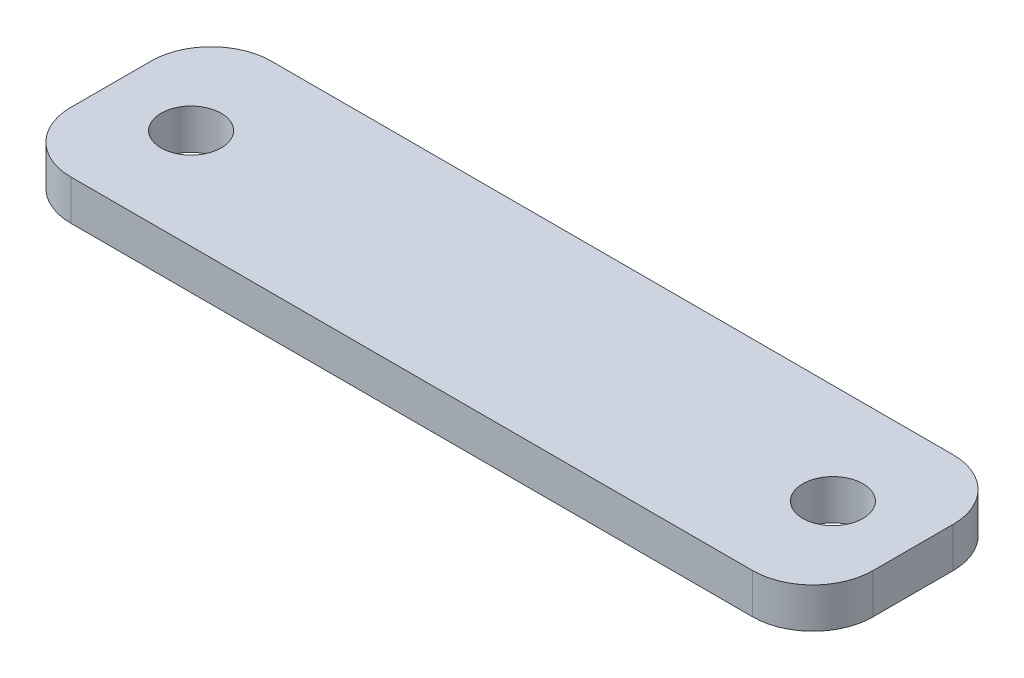
ISO-10303-21;
HEADER;
FILE_DESCRIPTION(('STEP AP214'),'2;1');
FILE_NAME('part.step','',(''),(''),'','','');
FILE_SCHEMA(('AUTOMOTIVE_DESIGN { 1 0 10303 214 1 1 1 1 }'));
ENDSEC;
DATA;
#1=APPLICATION_CONTEXT('core data for automotive mechanical design processes');
#2=APPLICATION_PROTOCOL_DEFINITION('international standard','automotive_design',2000,#1);
#3=PRODUCT_CONTEXT('',#1,'mechanical');
#4=PRODUCT('Part','Part','',(#3));
#5=PRODUCT_RELATED_PRODUCT_CATEGORY('part','',(#4));
#6=PRODUCT_DEFINITION_FORMATION('','',#4);
#7=PRODUCT_DEFINITION_CONTEXT('part definition',#1,'design');
#8=PRODUCT_DEFINITION('design','',#6,#7);
#9=PRODUCT_DEFINITION_SHAPE('','',#8);
#10=(LENGTH_UNIT() NAMED_UNIT(*) SI_UNIT(.MILLI.,.METRE.));
#11=(NAMED_UNIT(*) PLANE_ANGLE_UNIT() SI_UNIT($,.RADIAN.));
#12=(NAMED_UNIT(*) SI_UNIT($,.STERADIAN.) SOLID_ANGLE_UNIT());
#13=UNCERTAINTY_MEASURE_WITH_UNIT(LENGTH_MEASURE(1.E-05),#10,'distance_accuracy_value','');
#14=(GEOMETRIC_REPRESENTATION_CONTEXT(3) GLOBAL_UNCERTAINTY_ASSIGNED_CONTEXT((#13)) GLOBAL_UNIT_ASSIGNED_CONTEXT((#10,
#11,#12)) REPRESENTATION_CONTEXT('',''));
#15=CARTESIAN_POINT('',(0.,0.,0.));
#16=DIRECTION('',(0.,0.,1.));
#17=DIRECTION('',(1.,0.,0.));
#18=AXIS2_PLACEMENT_3D('',#15,#16,#17);
#19=CARTESIAN_POINT('',(20.,2.,-5.));
#20=DIRECTION('',(-1.,0.,0.));
#21=DIRECTION('',(0.,0.,1.));
#22=AXIS2_PLACEMENT_3D('',#19,#20,#21);
#23=PLANE('',#22);
#24=DIRECTION('',(0.,0.,-1.));
#25=VECTOR('',#24,1.);
#26=CARTESIAN_POINT('',(20.,2.,-5.));
#27=LINE('',#26,#25);
#28=CARTESIAN_POINT('',(20.,2.,2.));
#29=VERTEX_POINT('',#28);
#30=CARTESIAN_POINT('',(20.,2.,-2.));
#31=VERTEX_POINT('',#30);
#32=EDGE_CURVE('E128',#29,#31,#27,.T.);
#33=ORIENTED_EDGE('',*,*,#32,.F.);
#34=DIRECTION('',(0.,-1.,0.));
#35=VECTOR('',#34,1.);
#36=CARTESIAN_POINT('',(20.,2.,2.));
#37=LINE('',#36,#35);
#38=CARTESIAN_POINT('',(20.,0.,2.));
#39=VERTEX_POINT('',#38);
#40=EDGE_CURVE('E11',#29,#39,#37,.T.);
#41=ORIENTED_EDGE('',*,*,#40,.T.);
#42=DIRECTION('',(0.,0.,-1.));
#43=VECTOR('',#42,1.);
#44=CARTESIAN_POINT('',(20.,0.,-5.));
#45=LINE('',#44,#43);
#46=CARTESIAN_POINT('',(20.,0.,-2.));
#47=VERTEX_POINT('',#46);
#48=EDGE_CURVE('E130',#39,#47,#45,.T.);
#49=ORIENTED_EDGE('',*,*,#48,.T.);
#50=DIRECTION('',(0.,-1.,0.));
#51=VECTOR('',#50,1.);
#52=CARTESIAN_POINT('',(20.,2.,-2.));
#53=LINE('',#52,#51);
#54=EDGE_CURVE('E41',#47,#31,#53,.F.);
#55=ORIENTED_EDGE('',*,*,#54,.T.);
#56=EDGE_LOOP('',(#33,#41,#49,#55));
#57=FACE_BOUND('',#56,.T.);
#58=ADVANCED_FACE('F33',(#57),#23,.F.);
#59=CARTESIAN_POINT('',(-20.,2.,-5.));
#60=DIRECTION('',(0.,0.,1.));
#61=DIRECTION('',(1.,0.,0.));
#62=AXIS2_PLACEMENT_3D('',#59,#60,#61);
#63=PLANE('',#62);
#64=DIRECTION('',(-1.,0.,0.));
#65=VECTOR('',#64,1.);
#66=CARTESIAN_POINT('',(-20.,0.,-5.));
#67=LINE('',#66,#65);
#68=CARTESIAN_POINT('',(17.,0.,-5.));
#69=VERTEX_POINT('',#68);
#70=CARTESIAN_POINT('',(-17.,0.,-5.));
#71=VERTEX_POINT('',#70);
#72=EDGE_CURVE('E126',#69,#71,#67,.T.);
#73=ORIENTED_EDGE('',*,*,#72,.T.);
#74=DIRECTION('',(0.,-1.,0.));
#75=VECTOR('',#74,1.);
#76=CARTESIAN_POINT('',(-17.,2.,-5.));
#77=LINE('',#76,#75);
#78=CARTESIAN_POINT('',(-17.,2.,-5.));
#79=VERTEX_POINT('',#78);
#80=EDGE_CURVE('E105',#71,#79,#77,.F.);
#81=ORIENTED_EDGE('',*,*,#80,.T.);
#82=DIRECTION('',(-1.,0.,0.));
#83=VECTOR('',#82,1.);
#84=CARTESIAN_POINT('',(-20.,2.,-5.));
#85=LINE('',#84,#83);
#86=CARTESIAN_POINT('',(17.,2.,-5.));
#87=VERTEX_POINT('',#86);
#88=EDGE_CURVE('E166',#87,#79,#85,.T.);
#89=ORIENTED_EDGE('',*,*,#88,.F.);
#90=DIRECTION('',(0.,-1.,0.));
#91=VECTOR('',#90,1.);
#92=CARTESIAN_POINT('',(17.,2.,-5.));
#93=LINE('',#92,#91);
#94=EDGE_CURVE('E110',#87,#69,#93,.T.);
#95=ORIENTED_EDGE('',*,*,#94,.T.);
#96=EDGE_LOOP('',(#73,#81,#89,#95));
#97=FACE_BOUND('',#96,.T.);
#98=ADVANCED_FACE('F170',(#97),#63,.F.);
#99=CARTESIAN_POINT('',(-20.,2.,-5.));
#100=DIRECTION('',(1.,0.,0.));
#101=DIRECTION('',(0.,0.,-1.));
#102=AXIS2_PLACEMENT_3D('',#99,#100,#101);
#103=PLANE('',#102);
#104=DIRECTION('',(0.,0.,1.));
#105=VECTOR('',#104,1.);
#106=CARTESIAN_POINT('',(-20.,2.,-5.));
#107=LINE('',#106,#105);
#108=CARTESIAN_POINT('',(-20.,2.,-2.));
#109=VERTEX_POINT('',#108);
#110=CARTESIAN_POINT('',(-20.,2.,2.));
#111=VERTEX_POINT('',#110);
#112=EDGE_CURVE('E119',#109,#111,#107,.T.);
#113=ORIENTED_EDGE('',*,*,#112,.F.);
#114=DIRECTION('',(0.,-1.,0.));
#115=VECTOR('',#114,1.);
#116=CARTESIAN_POINT('',(-20.,2.,-2.));
#117=LINE('',#116,#115);
#118=CARTESIAN_POINT('',(-20.,0.,-2.));
#119=VERTEX_POINT('',#118);
#120=EDGE_CURVE('E104',#109,#119,#117,.T.);
#121=ORIENTED_EDGE('',*,*,#120,.T.);
#122=DIRECTION('',(0.,0.,1.));
#123=VECTOR('',#122,1.);
#124=CARTESIAN_POINT('',(-20.,0.,-5.));
#125=LINE('',#124,#123);
#126=CARTESIAN_POINT('',(-20.,0.,2.));
#127=VERTEX_POINT('',#126);
#128=EDGE_CURVE('E117',#119,#127,#125,.T.);
#129=ORIENTED_EDGE('',*,*,#128,.T.);
#130=DIRECTION('',(0.,-1.,0.));
#131=VECTOR('',#130,1.);
#132=CARTESIAN_POINT('',(-20.,2.,2.));
#133=LINE('',#132,#131);
#134=EDGE_CURVE('E121',#127,#111,#133,.F.);
#135=ORIENTED_EDGE('',*,*,#134,.T.);
#136=EDGE_LOOP('',(#113,#121,#129,#135));
#137=FACE_BOUND('',#136,.T.);
#138=ADVANCED_FACE('F116',(#137),#103,.F.);
#139=CARTESIAN_POINT('',(-20.,2.,5.));
#140=DIRECTION('',(0.,0.,-1.));
#141=DIRECTION('',(-1.,0.,0.));
#142=AXIS2_PLACEMENT_3D('',#139,#140,#141);
#143=PLANE('',#142);
#144=DIRECTION('',(1.,0.,0.));
#145=VECTOR('',#144,1.);
#146=CARTESIAN_POINT('',(-20.,2.,5.));
#147=LINE('',#146,#145);
#148=CARTESIAN_POINT('',(-17.,2.,5.));
#149=VERTEX_POINT('',#148);
#150=CARTESIAN_POINT('',(17.,2.,5.));
#151=VERTEX_POINT('',#150);
#152=EDGE_CURVE('E134',#149,#151,#147,.T.);
#153=ORIENTED_EDGE('',*,*,#152,.F.);
#154=DIRECTION('',(0.,-1.,0.));
#155=VECTOR('',#154,1.);
#156=CARTESIAN_POINT('',(-17.,2.,5.));
#157=LINE('',#156,#155);
#158=CARTESIAN_POINT('',(-17.,0.,5.));
#159=VERTEX_POINT('',#158);
#160=EDGE_CURVE('E151',#149,#159,#157,.T.);
#161=ORIENTED_EDGE('',*,*,#160,.T.);
#162=DIRECTION('',(1.,0.,0.));
#163=VECTOR('',#162,1.);
#164=CARTESIAN_POINT('',(-20.,0.,5.));
#165=LINE('',#164,#163);
#166=CARTESIAN_POINT('',(17.,0.,5.));
#167=VERTEX_POINT('',#166);
#168=EDGE_CURVE('E125',#159,#167,#165,.T.);
#169=ORIENTED_EDGE('',*,*,#168,.T.);
#170=DIRECTION('',(0.,-1.,0.));
#171=VECTOR('',#170,1.);
#172=CARTESIAN_POINT('',(17.,2.,5.));
#173=LINE('',#172,#171);
#174=EDGE_CURVE('E48',#167,#151,#173,.F.);
#175=ORIENTED_EDGE('',*,*,#174,.T.);
#176=EDGE_LOOP('',(#153,#161,#169,#175));
#177=FACE_BOUND('',#176,.T.);
#178=ADVANCED_FACE('F192',(#177),#143,.F.);
#179=CARTESIAN_POINT('',(0.,2.,0.));
#180=DIRECTION('',(0.,1.,0.));
#181=DIRECTION('',(0.,0.,1.));
#182=AXIS2_PLACEMENT_3D('',#179,#180,#181);
#183=PLANE('',#182);
#184=CARTESIAN_POINT('',(16.,2.,0.));
#185=DIRECTION('',(0.,1.,0.));
#186=DIRECTION('',(0.,0.,1.));
#187=AXIS2_PLACEMENT_3D('',#184,#185,#186);
#188=CIRCLE('',#187,1.5);
#189=CARTESIAN_POINT('',(16.,2.,1.5));
#190=VERTEX_POINT('',#189);
#191=EDGE_CURVE('E184',#190,#190,#188,.T.);
#192=ORIENTED_EDGE('',*,*,#191,.F.);
#193=EDGE_LOOP('',(#192));
#194=FACE_BOUND('',#193,.T.);
#195=CARTESIAN_POINT('',(-16.,2.,0.));
#196=DIRECTION('',(0.,1.,0.));
#197=DIRECTION('',(0.,0.,1.));
#198=AXIS2_PLACEMENT_3D('',#195,#196,#197);
#199=CIRCLE('',#198,1.5);
#200=CARTESIAN_POINT('',(-16.,2.,1.5));
#201=VERTEX_POINT('',#200);
#202=EDGE_CURVE('E173',#201,#201,#199,.T.);
#203=ORIENTED_EDGE('',*,*,#202,.F.);
#204=EDGE_LOOP('',(#203));
#205=FACE_BOUND('',#204,.T.);
#206=ORIENTED_EDGE('',*,*,#88,.T.);
#207=CARTESIAN_POINT('',(-17.,2.,-2.));
#208=DIRECTION('',(0.,1.,0.));
#209=DIRECTION('',(0.,0.,1.));
#210=AXIS2_PLACEMENT_3D('',#207,#208,#209);
#211=CIRCLE('',#210,3.);
#212=EDGE_CURVE('E148',#79,#109,#211,.T.);
#213=ORIENTED_EDGE('',*,*,#212,.T.);
#214=ORIENTED_EDGE('',*,*,#112,.T.);
#215=CARTESIAN_POINT('',(-17.,2.,2.));
#216=DIRECTION('',(0.,1.,0.));
#217=DIRECTION('',(0.,0.,1.));
#218=AXIS2_PLACEMENT_3D('',#215,#216,#217);
#219=CIRCLE('',#218,3.);
#220=EDGE_CURVE('E55',#111,#149,#219,.T.);
#221=ORIENTED_EDGE('',*,*,#220,.T.);
#222=ORIENTED_EDGE('',*,*,#152,.T.);
#223=CARTESIAN_POINT('',(17.,2.,2.));
#224=DIRECTION('',(0.,1.,0.));
#225=DIRECTION('',(0.,0.,1.));
#226=AXIS2_PLACEMENT_3D('',#223,#224,#225);
#227=CIRCLE('',#226,3.);
#228=EDGE_CURVE('E145',#151,#29,#227,.T.);
#229=ORIENTED_EDGE('',*,*,#228,.T.);
#230=ORIENTED_EDGE('',*,*,#32,.T.);
#231=CARTESIAN_POINT('',(17.,2.,-2.));
#232=DIRECTION('',(0.,1.,0.));
#233=DIRECTION('',(0.,0.,1.));
#234=AXIS2_PLACEMENT_3D('',#231,#232,#233);
#235=CIRCLE('',#234,3.);
#236=EDGE_CURVE('E143',#31,#87,#235,.T.);
#237=ORIENTED_EDGE('',*,*,#236,.T.);
#238=EDGE_LOOP('',(#206,#213,#214,#221,#222,#229,#230,#237));
#239=FACE_BOUND('',#238,.T.);
#240=ADVANCED_FACE('F163',(#194,#205,#239),#183,.T.);
#241=CARTESIAN_POINT('',(0.,0.,0.));
#242=DIRECTION('',(0.,1.,0.));
#243=DIRECTION('',(0.,0.,1.));
#244=AXIS2_PLACEMENT_3D('',#241,#242,#243);
#245=PLANE('',#244);
#246=CARTESIAN_POINT('',(16.,0.,0.));
#247=DIRECTION('',(0.,1.,0.));
#248=DIRECTION('',(0.,0.,1.));
#249=AXIS2_PLACEMENT_3D('',#246,#247,#248);
#250=CIRCLE('',#249,1.5);
#251=CARTESIAN_POINT('',(16.,0.,1.5));
#252=VERTEX_POINT('',#251);
#253=EDGE_CURVE('E181',#252,#252,#250,.T.);
#254=ORIENTED_EDGE('',*,*,#253,.T.);
#255=EDGE_LOOP('',(#254));
#256=FACE_BOUND('',#255,.T.);
#257=CARTESIAN_POINT('',(-16.,0.,0.));
#258=DIRECTION('',(0.,1.,0.));
#259=DIRECTION('',(0.,0.,1.));
#260=AXIS2_PLACEMENT_3D('',#257,#258,#259);
#261=CIRCLE('',#260,1.5);
#262=CARTESIAN_POINT('',(-16.,0.,1.5));
#263=VERTEX_POINT('',#262);
#264=EDGE_CURVE('E171',#263,#263,#261,.T.);
#265=ORIENTED_EDGE('',*,*,#264,.T.);
#266=EDGE_LOOP('',(#265));
#267=FACE_BOUND('',#266,.T.);
#268=ORIENTED_EDGE('',*,*,#128,.F.);
#269=CARTESIAN_POINT('',(-17.,0.,-2.));
#270=DIRECTION('',(0.,1.,0.));
#271=DIRECTION('',(0.,0.,1.));
#272=AXIS2_PLACEMENT_3D('',#269,#270,#271);
#273=CIRCLE('',#272,3.);
#274=EDGE_CURVE('E100',#119,#71,#273,.F.);
#275=ORIENTED_EDGE('',*,*,#274,.T.);
#276=ORIENTED_EDGE('',*,*,#72,.F.);
#277=CARTESIAN_POINT('',(17.,0.,-2.));
#278=DIRECTION('',(0.,1.,0.));
#279=DIRECTION('',(0.,0.,1.));
#280=AXIS2_PLACEMENT_3D('',#277,#278,#279);
#281=CIRCLE('',#280,3.);
#282=EDGE_CURVE('E120',#69,#47,#281,.F.);
#283=ORIENTED_EDGE('',*,*,#282,.T.);
#284=ORIENTED_EDGE('',*,*,#48,.F.);
#285=CARTESIAN_POINT('',(17.,0.,2.));
#286=DIRECTION('',(0.,1.,0.));
#287=DIRECTION('',(0.,0.,1.));
#288=AXIS2_PLACEMENT_3D('',#285,#286,#287);
#289=CIRCLE('',#288,3.);
#290=EDGE_CURVE('E137',#39,#167,#289,.F.);
#291=ORIENTED_EDGE('',*,*,#290,.T.);
#292=ORIENTED_EDGE('',*,*,#168,.F.);
#293=CARTESIAN_POINT('',(-17.,0.,2.));
#294=DIRECTION('',(0.,1.,0.));
#295=DIRECTION('',(0.,0.,1.));
#296=AXIS2_PLACEMENT_3D('',#293,#294,#295);
#297=CIRCLE('',#296,3.);
#298=EDGE_CURVE('E111',#159,#127,#297,.F.);
#299=ORIENTED_EDGE('',*,*,#298,.T.);
#300=EDGE_LOOP('',(#268,#275,#276,#283,#284,#291,#292,#299));
#301=FACE_BOUND('',#300,.T.);
#302=ADVANCED_FACE('F123',(#256,#267,#301),#245,.F.);
#303=CARTESIAN_POINT('',(-17.,2.,-2.));
#304=DIRECTION('',(0.,-1.,0.));
#305=DIRECTION('',(0.,0.,-1.));
#306=AXIS2_PLACEMENT_3D('',#303,#304,#305);
#307=CYLINDRICAL_SURFACE('',#306,3.);
#308=ORIENTED_EDGE('',*,*,#212,.F.);
#309=ORIENTED_EDGE('',*,*,#80,.F.);
#310=ORIENTED_EDGE('',*,*,#274,.F.);
#311=ORIENTED_EDGE('',*,*,#120,.F.);
#312=EDGE_LOOP('',(#308,#309,#310,#311));
#313=FACE_BOUND('',#312,.T.);
#314=ADVANCED_FACE('F103',(#313),#307,.T.);
#315=CARTESIAN_POINT('',(-17.,2.,2.));
#316=DIRECTION('',(0.,-1.,0.));
#317=DIRECTION('',(0.,0.,-1.));
#318=AXIS2_PLACEMENT_3D('',#315,#316,#317);
#319=CYLINDRICAL_SURFACE('',#318,3.);
#320=ORIENTED_EDGE('',*,*,#220,.F.);
#321=ORIENTED_EDGE('',*,*,#134,.F.);
#322=ORIENTED_EDGE('',*,*,#298,.F.);
#323=ORIENTED_EDGE('',*,*,#160,.F.);
#324=EDGE_LOOP('',(#320,#321,#322,#323));
#325=FACE_BOUND('',#324,.T.);
#326=ADVANCED_FACE('F218',(#325),#319,.T.);
#327=CARTESIAN_POINT('',(17.,2.,2.));
#328=DIRECTION('',(0.,-1.,0.));
#329=DIRECTION('',(0.,0.,-1.));
#330=AXIS2_PLACEMENT_3D('',#327,#328,#329);
#331=CYLINDRICAL_SURFACE('',#330,3.);
#332=ORIENTED_EDGE('',*,*,#228,.F.);
#333=ORIENTED_EDGE('',*,*,#174,.F.);
#334=ORIENTED_EDGE('',*,*,#290,.F.);
#335=ORIENTED_EDGE('',*,*,#40,.F.);
#336=EDGE_LOOP('',(#332,#333,#334,#335));
#337=FACE_BOUND('',#336,.T.);
#338=ADVANCED_FACE('F206',(#337),#331,.T.);
#339=CARTESIAN_POINT('',(17.,2.,-2.));
#340=DIRECTION('',(0.,-1.,0.));
#341=DIRECTION('',(0.,0.,-1.));
#342=AXIS2_PLACEMENT_3D('',#339,#340,#341);
#343=CYLINDRICAL_SURFACE('',#342,3.);
#344=ORIENTED_EDGE('',*,*,#236,.F.);
#345=ORIENTED_EDGE('',*,*,#54,.F.);
#346=ORIENTED_EDGE('',*,*,#282,.F.);
#347=ORIENTED_EDGE('',*,*,#94,.F.);
#348=EDGE_LOOP('',(#344,#345,#346,#347));
#349=FACE_BOUND('',#348,.T.);
#350=ADVANCED_FACE('F35',(#349),#343,.T.);
#351=CARTESIAN_POINT('',(-16.,2.,0.));
#352=DIRECTION('',(0.,1.,0.));
#353=DIRECTION('',(0.,0.,1.));
#354=AXIS2_PLACEMENT_3D('',#351,#352,#353);
#355=CYLINDRICAL_SURFACE('',#354,1.5);
#356=ORIENTED_EDGE('',*,*,#264,.F.);
#357=EDGE_LOOP('',(#356));
#358=FACE_BOUND('',#357,.T.);
#359=ORIENTED_EDGE('',*,*,#202,.T.);
#360=EDGE_LOOP('',(#359));
#361=FACE_BOUND('',#360,.T.);
#362=ADVANCED_FACE('F196',(#358,#361),#355,.F.);
#363=CARTESIAN_POINT('',(16.,2.,0.));
#364=DIRECTION('',(0.,1.,0.));
#365=DIRECTION('',(0.,0.,1.));
#366=AXIS2_PLACEMENT_3D('',#363,#364,#365);
#367=CYLINDRICAL_SURFACE('',#366,1.5);
#368=ORIENTED_EDGE('',*,*,#253,.F.);
#369=EDGE_LOOP('',(#368));
#370=FACE_BOUND('',#369,.T.);
#371=ORIENTED_EDGE('',*,*,#191,.T.);
#372=EDGE_LOOP('',(#371));
#373=FACE_BOUND('',#372,.T.);
#374=ADVANCED_FACE('F188',(#370,#373),#367,.F.);
#375=CLOSED_SHELL('',(#58,#98,#138,#178,#240,#302,#314,#326,#338,#350,#362,#374));
#376=MANIFOLD_SOLID_BREP('B2',#375);
#377=ADVANCED_BREP_SHAPE_REPRESENTATION('',(#18,#376),#14);
#378=SHAPE_DEFINITION_REPRESENTATION(#9,#377);
ENDSEC;
END-ISO-10303-21;
